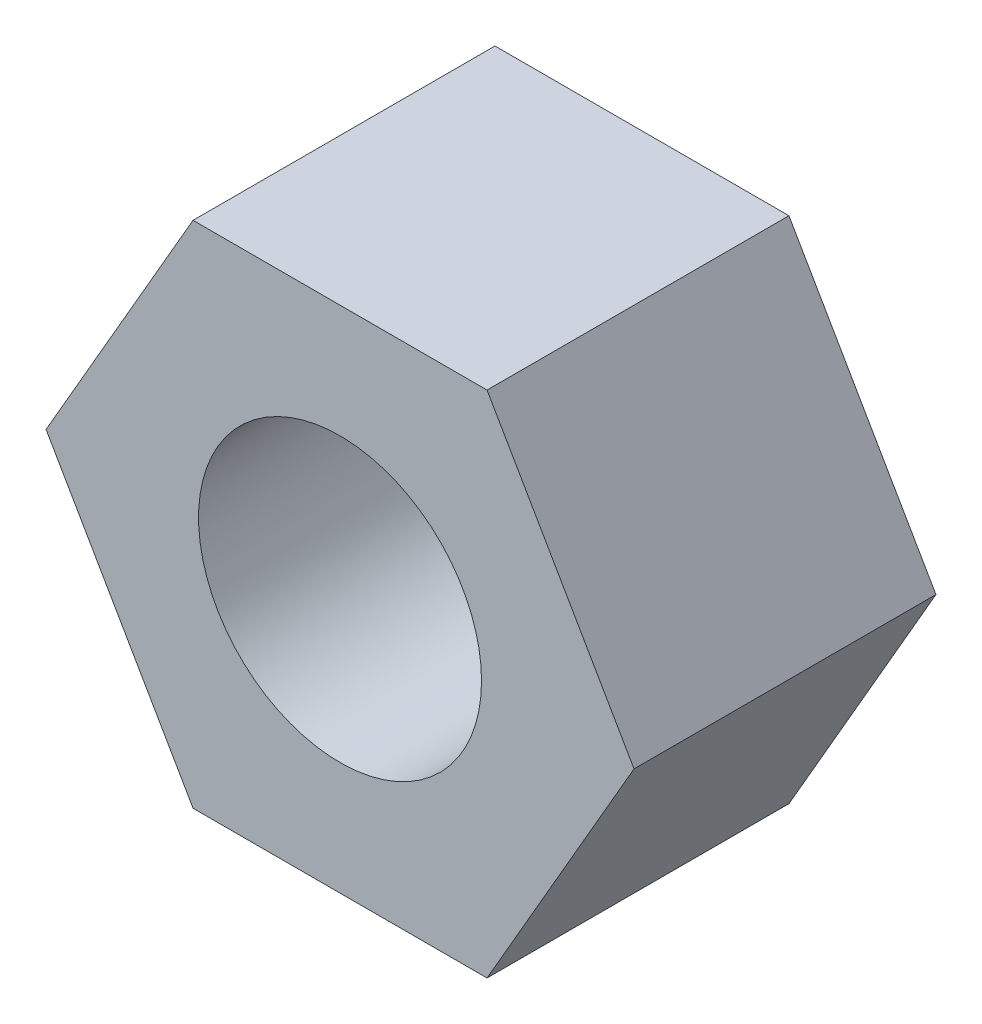
ISO-10303-21;
HEADER;
FILE_DESCRIPTION(('STEP AP214'),'2;1');
FILE_NAME('part.step','',(''),(''),'','','');
FILE_SCHEMA(('AUTOMOTIVE_DESIGN { 1 0 10303 214 1 1 1 1 }'));
ENDSEC;
DATA;
#1=APPLICATION_CONTEXT('core data for automotive mechanical design processes');
#2=APPLICATION_PROTOCOL_DEFINITION('international standard','automotive_design',2000,#1);
#3=PRODUCT_CONTEXT('',#1,'mechanical');
#4=PRODUCT('Part','Part','',(#3));
#5=PRODUCT_RELATED_PRODUCT_CATEGORY('part','',(#4));
#6=PRODUCT_DEFINITION_FORMATION('','',#4);
#7=PRODUCT_DEFINITION_CONTEXT('part definition',#1,'design');
#8=PRODUCT_DEFINITION('design','',#6,#7);
#9=PRODUCT_DEFINITION_SHAPE('','',#8);
#10=(LENGTH_UNIT() NAMED_UNIT(*) SI_UNIT(.MILLI.,.METRE.));
#11=(NAMED_UNIT(*) PLANE_ANGLE_UNIT() SI_UNIT($,.RADIAN.));
#12=(NAMED_UNIT(*) SI_UNIT($,.STERADIAN.) SOLID_ANGLE_UNIT());
#13=UNCERTAINTY_MEASURE_WITH_UNIT(LENGTH_MEASURE(1.E-05),#10,'distance_accuracy_value','');
#14=(GEOMETRIC_REPRESENTATION_CONTEXT(3) GLOBAL_UNCERTAINTY_ASSIGNED_CONTEXT((#13)) GLOBAL_UNIT_ASSIGNED_CONTEXT((#10,
#11,#12)) REPRESENTATION_CONTEXT('',''));
#15=CARTESIAN_POINT('',(0.,0.,0.));
#16=DIRECTION('',(0.,0.,1.));
#17=DIRECTION('',(1.,0.,0.));
#18=AXIS2_PLACEMENT_3D('',#15,#16,#17);
#19=CARTESIAN_POINT('',(0.,0.,8.509));
#20=DIRECTION('',(0.,0.,1.));
#21=DIRECTION('',(1.,0.,0.));
#22=AXIS2_PLACEMENT_3D('',#19,#20,#21);
#23=PLANE('',#22);
#24=DIRECTION('',(0.499999999999995,0.866025403784441,0.));
#25=VECTOR('',#24,1.);
#26=CARTESIAN_POINT('',(4.14277685657025,-7.17549999999996,8.509));
#27=LINE('',#26,#25);
#28=CARTESIAN_POINT('',(4.14277685657025,-7.17549999999996,8.509));
#29=VERTEX_POINT('',#28);
#30=CARTESIAN_POINT('',(8.28555371314033,0.,8.509));
#31=VERTEX_POINT('',#30);
#32=EDGE_CURVE('E129',#29,#31,#27,.T.);
#33=ORIENTED_EDGE('',*,*,#32,.T.);
#34=DIRECTION('',(-0.500000000000001,0.866025403784438,0.));
#35=VECTOR('',#34,1.);
#36=CARTESIAN_POINT('',(8.28555371314033,0.,8.509));
#37=LINE('',#36,#35);
#38=CARTESIAN_POINT('',(4.14277685657015,7.17550000000001,8.509));
#39=VERTEX_POINT('',#38);
#40=EDGE_CURVE('E87',#31,#39,#37,.T.);
#41=ORIENTED_EDGE('',*,*,#40,.T.);
#42=DIRECTION('',(-1.,0.,0.));
#43=VECTOR('',#42,1.);
#44=CARTESIAN_POINT('',(4.14277685657015,7.17550000000001,8.509));
#45=LINE('',#44,#43);
#46=CARTESIAN_POINT('',(-4.14277685657019,7.17549999999999,8.509));
#47=VERTEX_POINT('',#46);
#48=EDGE_CURVE('E100',#39,#47,#45,.T.);
#49=ORIENTED_EDGE('',*,*,#48,.T.);
#50=DIRECTION('',(-0.499999999999995,-0.866025403784441,0.));
#51=VECTOR('',#50,1.);
#52=CARTESIAN_POINT('',(-4.14277685657019,7.17549999999999,8.509));
#53=LINE('',#52,#51);
#54=CARTESIAN_POINT('',(-8.28555371314033,0.,8.509));
#55=VERTEX_POINT('',#54);
#56=EDGE_CURVE('E94',#47,#55,#53,.T.);
#57=ORIENTED_EDGE('',*,*,#56,.T.);
#58=DIRECTION('',(0.500000000000007,-0.866025403784434,0.));
#59=VECTOR('',#58,1.);
#60=CARTESIAN_POINT('',(-8.28555371314033,0.,8.509));
#61=LINE('',#60,#59);
#62=CARTESIAN_POINT('',(-4.1427768565701,-7.17550000000004,8.509));
#63=VERTEX_POINT('',#62);
#64=EDGE_CURVE('E98',#55,#63,#61,.T.);
#65=ORIENTED_EDGE('',*,*,#64,.T.);
#66=DIRECTION('',(1.,0.,0.));
#67=VECTOR('',#66,1.);
#68=CARTESIAN_POINT('',(-4.1427768565701,-7.17550000000004,8.509));
#69=LINE('',#68,#67);
#70=EDGE_CURVE('E50',#63,#29,#69,.T.);
#71=ORIENTED_EDGE('',*,*,#70,.T.);
#72=EDGE_LOOP('',(#33,#41,#49,#57,#65,#71));
#73=FACE_BOUND('',#72,.T.);
#74=CARTESIAN_POINT('',(0.,0.,8.509));
#75=DIRECTION('',(0.,0.,1.));
#76=DIRECTION('',(1.,0.,0.));
#77=AXIS2_PLACEMENT_3D('',#74,#75,#76);
#78=CIRCLE('',#77,3.9878);
#79=CARTESIAN_POINT('',(3.9878,0.,8.509));
#80=VERTEX_POINT('',#79);
#81=EDGE_CURVE('E122',#80,#80,#78,.T.);
#82=ORIENTED_EDGE('',*,*,#81,.F.);
#83=EDGE_LOOP('',(#82));
#84=FACE_BOUND('',#83,.T.);
#85=ADVANCED_FACE('F33',(#73,#84),#23,.T.);
#86=CARTESIAN_POINT('',(0.,0.,0.));
#87=DIRECTION('',(0.,0.,1.));
#88=DIRECTION('',(1.,0.,0.));
#89=AXIS2_PLACEMENT_3D('',#86,#87,#88);
#90=PLANE('',#89);
#91=DIRECTION('',(0.499999999999995,0.866025403784441,0.));
#92=VECTOR('',#91,1.);
#93=CARTESIAN_POINT('',(4.14277685657025,-7.17549999999996,0.));
#94=LINE('',#93,#92);
#95=CARTESIAN_POINT('',(4.14277685657025,-7.17549999999996,0.));
#96=VERTEX_POINT('',#95);
#97=CARTESIAN_POINT('',(8.28555371314033,0.,0.));
#98=VERTEX_POINT('',#97);
#99=EDGE_CURVE('E118',#96,#98,#94,.T.);
#100=ORIENTED_EDGE('',*,*,#99,.F.);
#101=DIRECTION('',(1.,0.,0.));
#102=VECTOR('',#101,1.);
#103=CARTESIAN_POINT('',(-4.1427768565701,-7.17550000000004,0.));
#104=LINE('',#103,#102);
#105=CARTESIAN_POINT('',(-4.1427768565701,-7.17550000000004,0.));
#106=VERTEX_POINT('',#105);
#107=EDGE_CURVE('E79',#106,#96,#104,.T.);
#108=ORIENTED_EDGE('',*,*,#107,.F.);
#109=DIRECTION('',(0.500000000000007,-0.866025403784434,0.));
#110=VECTOR('',#109,1.);
#111=CARTESIAN_POINT('',(-8.28555371314033,0.,0.));
#112=LINE('',#111,#110);
#113=CARTESIAN_POINT('',(-8.28555371314033,0.,0.));
#114=VERTEX_POINT('',#113);
#115=EDGE_CURVE('E73',#114,#106,#112,.T.);
#116=ORIENTED_EDGE('',*,*,#115,.F.);
#117=DIRECTION('',(-0.499999999999995,-0.866025403784441,0.));
#118=VECTOR('',#117,1.);
#119=CARTESIAN_POINT('',(-4.14277685657019,7.17549999999999,0.));
#120=LINE('',#119,#118);
#121=CARTESIAN_POINT('',(-4.14277685657019,7.17549999999999,0.));
#122=VERTEX_POINT('',#121);
#123=EDGE_CURVE('E108',#122,#114,#120,.T.);
#124=ORIENTED_EDGE('',*,*,#123,.F.);
#125=DIRECTION('',(-1.,0.,0.));
#126=VECTOR('',#125,1.);
#127=CARTESIAN_POINT('',(4.14277685657015,7.17550000000001,0.));
#128=LINE('',#127,#126);
#129=CARTESIAN_POINT('',(4.14277685657015,7.17550000000001,0.));
#130=VERTEX_POINT('',#129);
#131=EDGE_CURVE('E124',#130,#122,#128,.T.);
#132=ORIENTED_EDGE('',*,*,#131,.F.);
#133=DIRECTION('',(-0.500000000000001,0.866025403784438,0.));
#134=VECTOR('',#133,1.);
#135=CARTESIAN_POINT('',(8.28555371314033,0.,0.));
#136=LINE('',#135,#134);
#137=EDGE_CURVE('E121',#98,#130,#136,.T.);
#138=ORIENTED_EDGE('',*,*,#137,.F.);
#139=EDGE_LOOP('',(#100,#108,#116,#124,#132,#138));
#140=FACE_BOUND('',#139,.T.);
#141=CARTESIAN_POINT('',(0.,0.,0.));
#142=DIRECTION('',(0.,0.,1.));
#143=DIRECTION('',(1.,0.,0.));
#144=AXIS2_PLACEMENT_3D('',#141,#142,#143);
#145=CIRCLE('',#144,3.9878);
#146=CARTESIAN_POINT('',(3.9878,0.,0.));
#147=VERTEX_POINT('',#146);
#148=EDGE_CURVE('E222',#147,#147,#145,.T.);
#149=ORIENTED_EDGE('',*,*,#148,.T.);
#150=EDGE_LOOP('',(#149));
#151=FACE_BOUND('',#150,.T.);
#152=ADVANCED_FACE('F138',(#140,#151),#90,.F.);
#153=CARTESIAN_POINT('',(4.14277685657025,-7.17549999999996,8.509));
#154=DIRECTION('',(-0.866025403784441,0.499999999999995,0.));
#155=DIRECTION('',(-0.499999999999995,-0.866025403784441,0.));
#156=AXIS2_PLACEMENT_3D('',#153,#154,#155);
#157=PLANE('',#156);
#158=ORIENTED_EDGE('',*,*,#99,.T.);
#159=DIRECTION('',(0.,0.,-1.));
#160=VECTOR('',#159,1.);
#161=CARTESIAN_POINT('',(8.28555371314033,0.,8.509));
#162=LINE('',#161,#160);
#163=EDGE_CURVE('E11',#31,#98,#162,.T.);
#164=ORIENTED_EDGE('',*,*,#163,.F.);
#165=ORIENTED_EDGE('',*,*,#32,.F.);
#166=DIRECTION('',(0.,0.,-1.));
#167=VECTOR('',#166,1.);
#168=CARTESIAN_POINT('',(4.14277685657025,-7.17549999999996,8.509));
#169=LINE('',#168,#167);
#170=EDGE_CURVE('E114',#29,#96,#169,.T.);
#171=ORIENTED_EDGE('',*,*,#170,.T.);
#172=EDGE_LOOP('',(#158,#164,#165,#171));
#173=FACE_BOUND('',#172,.T.);
#174=ADVANCED_FACE('F35',(#173),#157,.F.);
#175=CARTESIAN_POINT('',(8.28555371314033,0.,8.509));
#176=DIRECTION('',(-0.866025403784438,-0.500000000000001,0.));
#177=DIRECTION('',(0.500000000000001,-0.866025403784438,0.));
#178=AXIS2_PLACEMENT_3D('',#175,#176,#177);
#179=PLANE('',#178);
#180=ORIENTED_EDGE('',*,*,#137,.T.);
#181=DIRECTION('',(0.,0.,-1.));
#182=VECTOR('',#181,1.);
#183=CARTESIAN_POINT('',(4.14277685657015,7.17550000000001,8.509));
#184=LINE('',#183,#182);
#185=EDGE_CURVE('E42',#39,#130,#184,.T.);
#186=ORIENTED_EDGE('',*,*,#185,.F.);
#187=ORIENTED_EDGE('',*,*,#40,.F.);
#188=ORIENTED_EDGE('',*,*,#163,.T.);
#189=EDGE_LOOP('',(#180,#186,#187,#188));
#190=FACE_BOUND('',#189,.T.);
#191=ADVANCED_FACE('F163',(#190),#179,.F.);
#192=CARTESIAN_POINT('',(4.14277685657015,7.17550000000001,8.509));
#193=DIRECTION('',(0.,-1.,0.));
#194=DIRECTION('',(1.,0.,0.));
#195=AXIS2_PLACEMENT_3D('',#192,#193,#194);
#196=PLANE('',#195);
#197=ORIENTED_EDGE('',*,*,#131,.T.);
#198=DIRECTION('',(0.,0.,-1.));
#199=VECTOR('',#198,1.);
#200=CARTESIAN_POINT('',(-4.14277685657019,7.17549999999999,8.509));
#201=LINE('',#200,#199);
#202=EDGE_CURVE('E109',#47,#122,#201,.T.);
#203=ORIENTED_EDGE('',*,*,#202,.F.);
#204=ORIENTED_EDGE('',*,*,#48,.F.);
#205=ORIENTED_EDGE('',*,*,#185,.T.);
#206=EDGE_LOOP('',(#197,#203,#204,#205));
#207=FACE_BOUND('',#206,.T.);
#208=ADVANCED_FACE('F135',(#207),#196,.F.);
#209=CARTESIAN_POINT('',(-4.14277685657019,7.17549999999999,8.509));
#210=DIRECTION('',(0.866025403784441,-0.499999999999995,0.));
#211=DIRECTION('',(0.499999999999995,0.866025403784442,0.));
#212=AXIS2_PLACEMENT_3D('',#209,#210,#211);
#213=PLANE('',#212);
#214=ORIENTED_EDGE('',*,*,#123,.T.);
#215=DIRECTION('',(0.,0.,-1.));
#216=VECTOR('',#215,1.);
#217=CARTESIAN_POINT('',(-8.28555371314033,0.,8.509));
#218=LINE('',#217,#216);
#219=EDGE_CURVE('E105',#55,#114,#218,.T.);
#220=ORIENTED_EDGE('',*,*,#219,.F.);
#221=ORIENTED_EDGE('',*,*,#56,.F.);
#222=ORIENTED_EDGE('',*,*,#202,.T.);
#223=EDGE_LOOP('',(#214,#220,#221,#222));
#224=FACE_BOUND('',#223,.T.);
#225=ADVANCED_FACE('F106',(#224),#213,.F.);
#226=CARTESIAN_POINT('',(-8.28555371314033,0.,8.509));
#227=DIRECTION('',(0.866025403784434,0.500000000000007,0.));
#228=DIRECTION('',(-0.500000000000007,0.866025403784435,0.));
#229=AXIS2_PLACEMENT_3D('',#226,#227,#228);
#230=PLANE('',#229);
#231=ORIENTED_EDGE('',*,*,#115,.T.);
#232=DIRECTION('',(0.,0.,-1.));
#233=VECTOR('',#232,1.);
#234=CARTESIAN_POINT('',(-4.1427768565701,-7.17550000000004,8.509));
#235=LINE('',#234,#233);
#236=EDGE_CURVE('E110',#63,#106,#235,.T.);
#237=ORIENTED_EDGE('',*,*,#236,.F.);
#238=ORIENTED_EDGE('',*,*,#64,.F.);
#239=ORIENTED_EDGE('',*,*,#219,.T.);
#240=EDGE_LOOP('',(#231,#237,#238,#239));
#241=FACE_BOUND('',#240,.T.);
#242=ADVANCED_FACE('F112',(#241),#230,.F.);
#243=CARTESIAN_POINT('',(-4.1427768565701,-7.17550000000004,8.509));
#244=DIRECTION('',(0.,1.,0.));
#245=DIRECTION('',(-1.,0.,0.));
#246=AXIS2_PLACEMENT_3D('',#243,#244,#245);
#247=PLANE('',#246);
#248=ORIENTED_EDGE('',*,*,#107,.T.);
#249=ORIENTED_EDGE('',*,*,#170,.F.);
#250=ORIENTED_EDGE('',*,*,#70,.F.);
#251=ORIENTED_EDGE('',*,*,#236,.T.);
#252=EDGE_LOOP('',(#248,#249,#250,#251));
#253=FACE_BOUND('',#252,.T.);
#254=ADVANCED_FACE('F143',(#253),#247,.F.);
#255=CARTESIAN_POINT('',(0.,0.,8.509));
#256=DIRECTION('',(0.,0.,-1.));
#257=DIRECTION('',(-1.,0.,0.));
#258=AXIS2_PLACEMENT_3D('',#255,#256,#257);
#259=CYLINDRICAL_SURFACE('',#258,3.9878);
#260=ORIENTED_EDGE('',*,*,#81,.T.);
#261=EDGE_LOOP('',(#260));
#262=FACE_BOUND('',#261,.T.);
#263=ORIENTED_EDGE('',*,*,#148,.F.);
#264=EDGE_LOOP('',(#263));
#265=FACE_BOUND('',#264,.T.);
#266=ADVANCED_FACE('F145',(#262,#265),#259,.F.);
#267=CLOSED_SHELL('',(#85,#152,#174,#191,#208,#225,#242,#254,#266));
#268=MANIFOLD_SOLID_BREP('B2',#267);
#269=ADVANCED_BREP_SHAPE_REPRESENTATION('',(#18,#268),#14);
#270=SHAPE_DEFINITION_REPRESENTATION(#9,#269);
ENDSEC;
END-ISO-10303-21;
